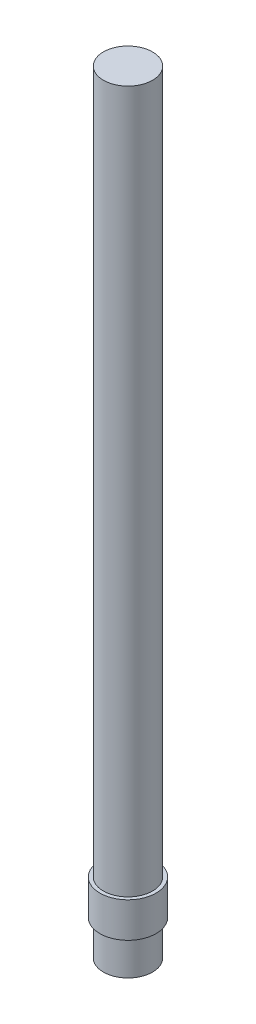
ISO-10303-21;
HEADER;
FILE_DESCRIPTION(('STEP AP214'),'2;1');
FILE_NAME('part.step','',(''),(''),'','','');
FILE_SCHEMA(('AUTOMOTIVE_DESIGN { 1 0 10303 214 1 1 1 1 }'));
ENDSEC;
DATA;
#1=APPLICATION_CONTEXT('core data for automotive mechanical design processes');
#2=APPLICATION_PROTOCOL_DEFINITION('international standard','automotive_design',2000,#1);
#3=PRODUCT_CONTEXT('',#1,'mechanical');
#4=PRODUCT('Part','Part','',(#3));
#5=PRODUCT_RELATED_PRODUCT_CATEGORY('part','',(#4));
#6=PRODUCT_DEFINITION_FORMATION('','',#4);
#7=PRODUCT_DEFINITION_CONTEXT('part definition',#1,'design');
#8=PRODUCT_DEFINITION('design','',#6,#7);
#9=PRODUCT_DEFINITION_SHAPE('','',#8);
#10=(LENGTH_UNIT() NAMED_UNIT(*) SI_UNIT(.MILLI.,.METRE.));
#11=(NAMED_UNIT(*) PLANE_ANGLE_UNIT() SI_UNIT($,.RADIAN.));
#12=(NAMED_UNIT(*) SI_UNIT($,.STERADIAN.) SOLID_ANGLE_UNIT());
#13=UNCERTAINTY_MEASURE_WITH_UNIT(LENGTH_MEASURE(1.E-05),#10,'distance_accuracy_value','');
#14=(GEOMETRIC_REPRESENTATION_CONTEXT(3) GLOBAL_UNCERTAINTY_ASSIGNED_CONTEXT((#13)) GLOBAL_UNIT_ASSIGNED_CONTEXT((#10,
#11,#12)) REPRESENTATION_CONTEXT('',''));
#15=CARTESIAN_POINT('',(0.,0.,0.));
#16=DIRECTION('',(0.,0.,1.));
#17=DIRECTION('',(1.,0.,0.));
#18=AXIS2_PLACEMENT_3D('',#15,#16,#17);
#19=CARTESIAN_POINT('',(0.,5.,0.));
#20=DIRECTION('',(0.,-1.,0.));
#21=DIRECTION('',(0.,0.,-1.));
#22=AXIS2_PLACEMENT_3D('',#19,#20,#21);
#23=CYLINDRICAL_SURFACE('',#22,3.5);
#24=CARTESIAN_POINT('',(0.,5.,0.));
#25=DIRECTION('',(0.,1.,0.));
#26=DIRECTION('',(0.,0.,1.));
#27=AXIS2_PLACEMENT_3D('',#24,#25,#26);
#28=CIRCLE('',#27,3.5);
#29=CARTESIAN_POINT('',(0.,5.,3.5));
#30=VERTEX_POINT('',#29);
#31=EDGE_CURVE('E42',#30,#30,#28,.T.);
#32=ORIENTED_EDGE('',*,*,#31,.F.);
#33=EDGE_LOOP('',(#32));
#34=FACE_BOUND('',#33,.T.);
#35=CARTESIAN_POINT('',(0.,0.,0.));
#36=DIRECTION('',(0.,1.,0.));
#37=DIRECTION('',(0.,0.,1.));
#38=AXIS2_PLACEMENT_3D('',#35,#36,#37);
#39=CIRCLE('',#38,3.5);
#40=CARTESIAN_POINT('',(0.,0.,3.5));
#41=VERTEX_POINT('',#40);
#42=EDGE_CURVE('E38',#41,#41,#39,.T.);
#43=ORIENTED_EDGE('',*,*,#42,.T.);
#44=EDGE_LOOP('',(#43));
#45=FACE_BOUND('',#44,.T.);
#46=ADVANCED_FACE('F35',(#34,#45),#23,.T.);
#47=CARTESIAN_POINT('',(0.,0.,0.));
#48=DIRECTION('',(0.,1.,0.));
#49=DIRECTION('',(0.,0.,1.));
#50=AXIS2_PLACEMENT_3D('',#47,#48,#49);
#51=PLANE('',#50);
#52=ORIENTED_EDGE('',*,*,#42,.F.);
#53=EDGE_LOOP('',(#52));
#54=FACE_BOUND('',#53,.T.);
#55=ADVANCED_FACE('F76',(#54),#51,.F.);
#56=CARTESIAN_POINT('',(0.,10.,0.));
#57=DIRECTION('',(0.,-1.,0.));
#58=DIRECTION('',(0.,0.,-1.));
#59=AXIS2_PLACEMENT_3D('',#56,#57,#58);
#60=CYLINDRICAL_SURFACE('',#59,4.);
#61=CARTESIAN_POINT('',(0.,10.,0.));
#62=DIRECTION('',(0.,1.,0.));
#63=DIRECTION('',(0.,0.,1.));
#64=AXIS2_PLACEMENT_3D('',#61,#62,#63);
#65=CIRCLE('',#64,4.);
#66=CARTESIAN_POINT('',(0.,10.,4.));
#67=VERTEX_POINT('',#66);
#68=EDGE_CURVE('E50',#67,#67,#65,.T.);
#69=ORIENTED_EDGE('',*,*,#68,.F.);
#70=EDGE_LOOP('',(#69));
#71=FACE_BOUND('',#70,.T.);
#72=CARTESIAN_POINT('',(0.,5.,0.));
#73=DIRECTION('',(0.,1.,0.));
#74=DIRECTION('',(0.,0.,1.));
#75=AXIS2_PLACEMENT_3D('',#72,#73,#74);
#76=CIRCLE('',#75,4.);
#77=CARTESIAN_POINT('',(0.,5.,4.));
#78=VERTEX_POINT('',#77);
#79=EDGE_CURVE('E53',#78,#78,#76,.T.);
#80=ORIENTED_EDGE('',*,*,#79,.T.);
#81=EDGE_LOOP('',(#80));
#82=FACE_BOUND('',#81,.T.);
#83=ADVANCED_FACE('F81',(#71,#82),#60,.T.);
#84=CARTESIAN_POINT('',(0.,10.,0.));
#85=DIRECTION('',(0.,1.,0.));
#86=DIRECTION('',(0.,0.,1.));
#87=AXIS2_PLACEMENT_3D('',#84,#85,#86);
#88=PLANE('',#87);
#89=CARTESIAN_POINT('',(0.,10.,0.));
#90=DIRECTION('',(0.,1.,0.));
#91=DIRECTION('',(0.,0.,1.));
#92=AXIS2_PLACEMENT_3D('',#89,#90,#91);
#93=CIRCLE('',#92,3.5);
#94=CARTESIAN_POINT('',(0.,10.,3.5));
#95=VERTEX_POINT('',#94);
#96=EDGE_CURVE('E10',#95,#95,#93,.T.);
#97=ORIENTED_EDGE('',*,*,#96,.F.);
#98=EDGE_LOOP('',(#97));
#99=FACE_BOUND('',#98,.T.);
#100=ORIENTED_EDGE('',*,*,#68,.T.);
#101=EDGE_LOOP('',(#100));
#102=FACE_BOUND('',#101,.T.);
#103=ADVANCED_FACE('F71',(#99,#102),#88,.T.);
#104=CARTESIAN_POINT('',(0.,5.,0.));
#105=DIRECTION('',(0.,1.,0.));
#106=DIRECTION('',(0.,0.,1.));
#107=AXIS2_PLACEMENT_3D('',#104,#105,#106);
#108=PLANE('',#107);
#109=ORIENTED_EDGE('',*,*,#31,.T.);
#110=EDGE_LOOP('',(#109));
#111=FACE_BOUND('',#110,.T.);
#112=ORIENTED_EDGE('',*,*,#79,.F.);
#113=EDGE_LOOP('',(#112));
#114=FACE_BOUND('',#113,.T.);
#115=ADVANCED_FACE('F64',(#111,#114),#108,.F.);
#116=CARTESIAN_POINT('',(0.,110.,0.));
#117=DIRECTION('',(0.,-1.,0.));
#118=DIRECTION('',(0.,0.,-1.));
#119=AXIS2_PLACEMENT_3D('',#116,#117,#118);
#120=CYLINDRICAL_SURFACE('',#119,3.5);
#121=CARTESIAN_POINT('',(0.,110.,0.));
#122=DIRECTION('',(0.,1.,0.));
#123=DIRECTION('',(0.,0.,1.));
#124=AXIS2_PLACEMENT_3D('',#121,#122,#123);
#125=CIRCLE('',#124,3.5);
#126=CARTESIAN_POINT('',(0.,110.,3.5));
#127=VERTEX_POINT('',#126);
#128=EDGE_CURVE('E49',#127,#127,#125,.T.);
#129=ORIENTED_EDGE('',*,*,#128,.F.);
#130=EDGE_LOOP('',(#129));
#131=FACE_BOUND('',#130,.T.);
#132=ORIENTED_EDGE('',*,*,#96,.T.);
#133=EDGE_LOOP('',(#132));
#134=FACE_BOUND('',#133,.T.);
#135=ADVANCED_FACE('F62',(#131,#134),#120,.T.);
#136=CARTESIAN_POINT('',(0.,110.,0.));
#137=DIRECTION('',(0.,1.,0.));
#138=DIRECTION('',(0.,0.,1.));
#139=AXIS2_PLACEMENT_3D('',#136,#137,#138);
#140=PLANE('',#139);
#141=ORIENTED_EDGE('',*,*,#128,.T.);
#142=EDGE_LOOP('',(#141));
#143=FACE_BOUND('',#142,.T.);
#144=ADVANCED_FACE('F60',(#143),#140,.T.);
#145=CLOSED_SHELL('',(#46,#55,#83,#103,#115,#135,#144));
#146=MANIFOLD_SOLID_BREP('B2',#145);
#147=ADVANCED_BREP_SHAPE_REPRESENTATION('',(#18,#146),#14);
#148=SHAPE_DEFINITION_REPRESENTATION(#9,#147);
ENDSEC;
END-ISO-10303-21;
